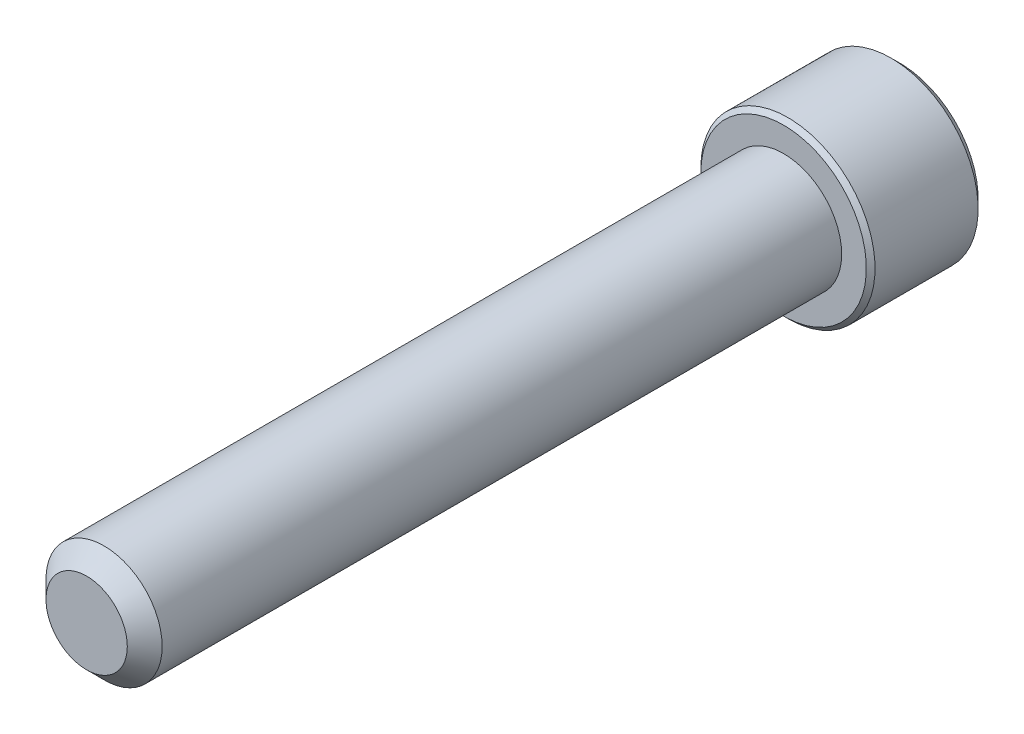
ISO-10303-21;
HEADER;
FILE_DESCRIPTION(('STEP AP214'),'2;1');
FILE_NAME('part.step','',(''),(''),'','','');
FILE_SCHEMA(('AUTOMOTIVE_DESIGN { 1 0 10303 214 1 1 1 1 }'));
ENDSEC;
DATA;
#1=APPLICATION_CONTEXT('core data for automotive mechanical design processes');
#2=APPLICATION_PROTOCOL_DEFINITION('international standard','automotive_design',2000,#1);
#3=PRODUCT_CONTEXT('',#1,'mechanical');
#4=PRODUCT('Part','Part','',(#3));
#5=PRODUCT_RELATED_PRODUCT_CATEGORY('part','',(#4));
#6=PRODUCT_DEFINITION_FORMATION('','',#4);
#7=PRODUCT_DEFINITION_CONTEXT('part definition',#1,'design');
#8=PRODUCT_DEFINITION('design','',#6,#7);
#9=PRODUCT_DEFINITION_SHAPE('','',#8);
#10=(LENGTH_UNIT() NAMED_UNIT(*) SI_UNIT(.MILLI.,.METRE.));
#11=(NAMED_UNIT(*) PLANE_ANGLE_UNIT() SI_UNIT($,.RADIAN.));
#12=(NAMED_UNIT(*) SI_UNIT($,.STERADIAN.) SOLID_ANGLE_UNIT());
#13=UNCERTAINTY_MEASURE_WITH_UNIT(LENGTH_MEASURE(1.E-05),#10,'distance_accuracy_value','');
#14=(GEOMETRIC_REPRESENTATION_CONTEXT(3) GLOBAL_UNCERTAINTY_ASSIGNED_CONTEXT((#13)) GLOBAL_UNIT_ASSIGNED_CONTEXT((#10,
#11,#12)) REPRESENTATION_CONTEXT('',''));
#15=CARTESIAN_POINT('',(0.,0.,0.));
#16=DIRECTION('',(0.,0.,1.));
#17=DIRECTION('',(1.,0.,0.));
#18=AXIS2_PLACEMENT_3D('',#15,#16,#17);
#19=CARTESIAN_POINT('',(0.,0.,-38.1));
#20=DIRECTION('',(0.,0.,1.));
#21=DIRECTION('',(1.,0.,0.));
#22=AXIS2_PLACEMENT_3D('',#19,#20,#21);
#23=CYLINDRICAL_SURFACE('',#22,3.175);
#24=CARTESIAN_POINT('',(0.,0.,-0.952499999999995));
#25=DIRECTION('',(0.,0.,1.));
#26=DIRECTION('',(1.,0.,0.));
#27=AXIS2_PLACEMENT_3D('',#24,#25,#26);
#28=CIRCLE('',#27,3.175);
#29=CARTESIAN_POINT('',(3.175,0.,-0.952499999999995));
#30=VERTEX_POINT('',#29);
#31=EDGE_CURVE('E109',#30,#30,#28,.F.);
#32=CARTESIAN_POINT('',(0.,0.,-38.1));
#33=DIRECTION('',(0.,0.,-1.));
#34=DIRECTION('',(-1.,0.,0.));
#35=AXIS2_PLACEMENT_3D('',#32,#33,#34);
#36=CIRCLE('',#35,3.175);
#37=CARTESIAN_POINT('',(3.175,0.,-38.1));
#38=VERTEX_POINT('',#37);
#39=EDGE_CURVE('E212',#38,#38,#36,.F.);
#40=CARTESIAN_POINT('',(3.175,0.,-0.952499999999995));
#41=CARTESIAN_POINT('',(3.175,0.,-1.339453125));
#42=CARTESIAN_POINT('',(3.175,0.,-1.72640625));
#43=CARTESIAN_POINT('',(3.175,0.,-2.5003125));
#44=CARTESIAN_POINT('',(3.175,0.,-2.887265625));
#45=CARTESIAN_POINT('',(3.175,0.,-3.661171875));
#46=CARTESIAN_POINT('',(3.175,0.,-4.048125));
#47=CARTESIAN_POINT('',(3.175,0.,-4.82203125));
#48=CARTESIAN_POINT('',(3.175,0.,-5.208984375));
#49=CARTESIAN_POINT('',(3.175,0.,-5.982890625));
#50=CARTESIAN_POINT('',(3.175,0.,-6.36984375));
#51=CARTESIAN_POINT('',(3.175,0.,-7.14375));
#52=CARTESIAN_POINT('',(3.175,0.,-7.53070312499999));
#53=CARTESIAN_POINT('',(3.175,0.,-8.30460937499999));
#54=CARTESIAN_POINT('',(3.175,0.,-8.69156249999999));
#55=CARTESIAN_POINT('',(3.175,0.,-9.46546874999999));
#56=CARTESIAN_POINT('',(3.175,0.,-9.85242187499999));
#57=CARTESIAN_POINT('',(3.175,0.,-10.626328125));
#58=CARTESIAN_POINT('',(3.175,0.,-11.01328125));
#59=CARTESIAN_POINT('',(3.175,0.,-11.7871875));
#60=CARTESIAN_POINT('',(3.175,0.,-12.174140625));
#61=CARTESIAN_POINT('',(3.175,0.,-12.948046875));
#62=CARTESIAN_POINT('',(3.175,0.,-13.335));
#63=CARTESIAN_POINT('',(3.175,0.,-14.10890625));
#64=CARTESIAN_POINT('',(3.175,0.,-14.495859375));
#65=CARTESIAN_POINT('',(3.175,0.,-15.269765625));
#66=CARTESIAN_POINT('',(3.175,0.,-15.65671875));
#67=CARTESIAN_POINT('',(3.175,0.,-16.430625));
#68=CARTESIAN_POINT('',(3.175,0.,-16.817578125));
#69=CARTESIAN_POINT('',(3.175,0.,-17.591484375));
#70=CARTESIAN_POINT('',(3.175,0.,-17.9784375));
#71=CARTESIAN_POINT('',(3.175,0.,-18.75234375));
#72=CARTESIAN_POINT('',(3.175,0.,-19.139296875));
#73=CARTESIAN_POINT('',(3.175,0.,-19.913203125));
#74=CARTESIAN_POINT('',(3.175,0.,-20.30015625));
#75=CARTESIAN_POINT('',(3.175,0.,-21.0740625));
#76=CARTESIAN_POINT('',(3.175,0.,-21.461015625));
#77=CARTESIAN_POINT('',(3.175,0.,-22.234921875));
#78=CARTESIAN_POINT('',(3.175,0.,-22.621875));
#79=CARTESIAN_POINT('',(3.175,0.,-23.39578125));
#80=CARTESIAN_POINT('',(3.175,0.,-23.782734375));
#81=CARTESIAN_POINT('',(3.175,0.,-24.556640625));
#82=CARTESIAN_POINT('',(3.175,0.,-24.94359375));
#83=CARTESIAN_POINT('',(3.175,0.,-25.7175));
#84=CARTESIAN_POINT('',(3.175,0.,-26.104453125));
#85=CARTESIAN_POINT('',(3.175,0.,-26.878359375));
#86=CARTESIAN_POINT('',(3.175,0.,-27.2653125));
#87=CARTESIAN_POINT('',(3.175,0.,-28.03921875));
#88=CARTESIAN_POINT('',(3.175,0.,-28.426171875));
#89=CARTESIAN_POINT('',(3.175,0.,-29.200078125));
#90=CARTESIAN_POINT('',(3.175,0.,-29.58703125));
#91=CARTESIAN_POINT('',(3.175,0.,-30.3609375));
#92=CARTESIAN_POINT('',(3.175,0.,-30.747890625));
#93=CARTESIAN_POINT('',(3.175,0.,-31.521796875));
#94=CARTESIAN_POINT('',(3.175,0.,-31.90875));
#95=CARTESIAN_POINT('',(3.175,0.,-32.68265625));
#96=CARTESIAN_POINT('',(3.175,0.,-33.069609375));
#97=CARTESIAN_POINT('',(3.175,0.,-33.843515625));
#98=CARTESIAN_POINT('',(3.175,0.,-34.23046875));
#99=CARTESIAN_POINT('',(3.175,0.,-35.004375));
#100=CARTESIAN_POINT('',(3.175,0.,-35.391328125));
#101=CARTESIAN_POINT('',(3.175,0.,-36.165234375));
#102=CARTESIAN_POINT('',(3.175,0.,-36.5521875));
#103=CARTESIAN_POINT('',(3.175,0.,-37.32609375));
#104=CARTESIAN_POINT('',(3.175,0.,-37.713046875));
#105=CARTESIAN_POINT('',(3.175,0.,-38.1));
#106=B_SPLINE_CURVE_WITH_KNOTS('',3,(#40,#41,#42,#43,#44,#45,#46,#47,#48,#49,#50,#51,#52,#53,
#54,#55,#56,#57,#58,#59,#60,#61,#62,#63,#64,#65,#66,#67,#68,#69,#70,#71,#72,#73,#74,#75,#76,#77,
#78,#79,#80,#81,#82,#83,#84,#85,#86,#87,#88,#89,#90,#91,#92,#93,#94,#95,#96,#97,#98,#99,#100,
#101,#102,#103,#104,#105),.UNSPECIFIED.,.F.,.F.,(4,2,2,2,2,2,2,2,2,2,2,2,2,2,2,2,2,2,2,2,2,2,2,
2,2,2,2,2,2,2,2,2,4),(0.,1.160859375,2.32171875,3.482578125,4.6434375,5.804296875,6.96515625,
8.126015625,9.286875,10.447734375,11.60859375,12.769453125,13.9303125,15.091171875,16.25203125,
17.412890625,18.57375,19.734609375,20.89546875,22.056328125,23.2171875,24.378046875,25.53890625,
26.699765625,27.860625,29.021484375,30.18234375,31.343203125,32.5040625,33.664921875,
34.82578125,35.986640625,37.1475),.UNSPECIFIED.);
#107=EDGE_CURVE('BSEAM35',#30,#38,#106,.T.);
#108=ORIENTED_EDGE('',*,*,#31,.T.);
#109=ORIENTED_EDGE('',*,*,#39,.T.);
#110=ORIENTED_EDGE('',*,*,#107,.T.);
#111=ORIENTED_EDGE('',*,*,#107,.F.);
#112=EDGE_LOOP('',(#108,#110,#109,#111));
#113=FACE_BOUND('',#112,.T.);
#114=ADVANCED_FACE('F35',(#113),#23,.T.);
#115=CARTESIAN_POINT('',(0.,0.,0.));
#116=DIRECTION('',(0.,0.,1.));
#117=DIRECTION('',(1.,0.,0.));
#118=AXIS2_PLACEMENT_3D('',#115,#116,#117);
#119=PLANE('',#118);
#120=CARTESIAN_POINT('',(0.,0.,0.));
#121=DIRECTION('',(0.,0.,1.));
#122=DIRECTION('',(1.,0.,0.));
#123=AXIS2_PLACEMENT_3D('',#120,#121,#122);
#124=CIRCLE('',#123,2.2225);
#125=CARTESIAN_POINT('',(2.2225,0.,0.));
#126=VERTEX_POINT('',#125);
#127=EDGE_CURVE('E211',#126,#126,#124,.T.);
#128=ORIENTED_EDGE('',*,*,#127,.T.);
#129=EDGE_LOOP('',(#128));
#130=FACE_BOUND('',#129,.T.);
#131=ADVANCED_FACE('F189',(#130),#119,.T.);
#132=CARTESIAN_POINT('',(0.,0.,0.));
#133=DIRECTION('',(0.,0.,-1.));
#134=DIRECTION('',(-1.,0.,0.));
#135=AXIS2_PLACEMENT_3D('',#132,#133,#134);
#136=CONICAL_SURFACE('',#135,2.2225,0.78539816339745);
#137=ORIENTED_EDGE('',*,*,#31,.F.);
#138=EDGE_LOOP('',(#137));
#139=FACE_BOUND('',#138,.T.);
#140=ORIENTED_EDGE('',*,*,#127,.F.);
#141=EDGE_LOOP('',(#140));
#142=FACE_BOUND('',#141,.T.);
#143=ADVANCED_FACE('F195',(#139,#142),#136,.T.);
#144=CARTESIAN_POINT('',(0.,0.,-44.45));
#145=DIRECTION('',(0.,0.,1.));
#146=DIRECTION('',(1.,0.,0.));
#147=AXIS2_PLACEMENT_3D('',#144,#145,#146);
#148=CYLINDRICAL_SURFACE('',#147,4.7625);
#149=CARTESIAN_POINT('',(0.,0.,-38.338125));
#150=DIRECTION('',(0.,0.,-1.));
#151=DIRECTION('',(-1.,0.,0.));
#152=AXIS2_PLACEMENT_3D('',#149,#150,#151);
#153=CIRCLE('',#152,4.7625);
#154=CARTESIAN_POINT('',(-4.7625,0.,-38.338125));
#155=VERTEX_POINT('',#154);
#156=EDGE_CURVE('E43',#155,#155,#153,.T.);
#157=ORIENTED_EDGE('',*,*,#156,.T.);
#158=EDGE_LOOP('',(#157));
#159=FACE_BOUND('',#158,.T.);
#160=CARTESIAN_POINT('',(0.,0.,-43.97375));
#161=DIRECTION('',(0.,0.,-1.));
#162=DIRECTION('',(-1.,0.,0.));
#163=AXIS2_PLACEMENT_3D('',#160,#161,#162);
#164=CIRCLE('',#163,4.7625);
#165=CARTESIAN_POINT('',(-4.7625,0.,-43.97375));
#166=VERTEX_POINT('',#165);
#167=EDGE_CURVE('E172',#166,#166,#164,.F.);
#168=ORIENTED_EDGE('',*,*,#167,.T.);
#169=EDGE_LOOP('',(#168));
#170=FACE_BOUND('',#169,.T.);
#171=ADVANCED_FACE('F177',(#159,#170),#148,.T.);
#172=CARTESIAN_POINT('',(0.,0.,-44.45));
#173=DIRECTION('',(0.,0.,-1.));
#174=DIRECTION('',(-1.,0.,0.));
#175=AXIS2_PLACEMENT_3D('',#172,#173,#174);
#176=PLANE('',#175);
#177=CARTESIAN_POINT('',(0.,0.,-44.45));
#178=DIRECTION('',(0.,0.,-1.));
#179=DIRECTION('',(-1.,0.,0.));
#180=AXIS2_PLACEMENT_3D('',#177,#178,#179);
#181=CIRCLE('',#180,4.28625000000001);
#182=CARTESIAN_POINT('',(-4.28625000000001,0.,-44.45));
#183=VERTEX_POINT('',#182);
#184=EDGE_CURVE('E108',#183,#183,#181,.T.);
#185=ORIENTED_EDGE('',*,*,#184,.T.);
#186=EDGE_LOOP('',(#185));
#187=FACE_BOUND('',#186,.T.);
#188=CARTESIAN_POINT('',(0.,0.,-44.45));
#189=DIRECTION('',(0.,0.,-1.));
#190=DIRECTION('',(-1.,0.,0.));
#191=AXIS2_PLACEMENT_3D('',#188,#189,#190);
#192=CIRCLE('',#191,2.74963065701559);
#193=CARTESIAN_POINT('',(-2.38125,1.3748153285078,-44.45));
#194=VERTEX_POINT('',#193);
#195=CARTESIAN_POINT('',(0.,2.74963065701559,-44.45));
#196=VERTEX_POINT('',#195);
#197=EDGE_CURVE('E89',#194,#196,#192,.T.);
#198=ORIENTED_EDGE('',*,*,#197,.F.);
#199=CARTESIAN_POINT('',(-2.38125,-1.3748153285078,-44.45));
#200=VERTEX_POINT('',#199);
#201=EDGE_CURVE('E49',#200,#194,#192,.T.);
#202=ORIENTED_EDGE('',*,*,#201,.F.);
#203=CARTESIAN_POINT('',(0.,-2.74963065701559,-44.45));
#204=VERTEX_POINT('',#203);
#205=EDGE_CURVE('E271',#204,#200,#192,.T.);
#206=ORIENTED_EDGE('',*,*,#205,.F.);
#207=CARTESIAN_POINT('',(2.38125,-1.37481532850779,-44.45));
#208=VERTEX_POINT('',#207);
#209=EDGE_CURVE('E56',#208,#204,#192,.T.);
#210=ORIENTED_EDGE('',*,*,#209,.F.);
#211=CARTESIAN_POINT('',(2.38125,1.3748153285078,-44.45));
#212=VERTEX_POINT('',#211);
#213=EDGE_CURVE('E130',#212,#208,#192,.T.);
#214=ORIENTED_EDGE('',*,*,#213,.F.);
#215=EDGE_CURVE('E98',#196,#212,#192,.T.);
#216=ORIENTED_EDGE('',*,*,#215,.F.);
#217=EDGE_LOOP('',(#198,#202,#206,#210,#214,#216));
#218=FACE_BOUND('',#217,.T.);
#219=ADVANCED_FACE('F129',(#187,#218),#176,.T.);
#220=CARTESIAN_POINT('',(0.,0.,-38.1));
#221=DIRECTION('',(0.,0.,-1.));
#222=DIRECTION('',(-1.,0.,0.));
#223=AXIS2_PLACEMENT_3D('',#220,#221,#222);
#224=PLANE('',#223);
#225=CARTESIAN_POINT('',(0.,0.,-38.1));
#226=DIRECTION('',(0.,0.,-1.));
#227=DIRECTION('',(-1.,0.,0.));
#228=AXIS2_PLACEMENT_3D('',#225,#226,#227);
#229=CIRCLE('',#228,4.524375);
#230=CARTESIAN_POINT('',(-4.524375,0.,-38.1));
#231=VERTEX_POINT('',#230);
#232=EDGE_CURVE('E11',#231,#231,#229,.F.);
#233=ORIENTED_EDGE('',*,*,#232,.T.);
#234=EDGE_LOOP('',(#233));
#235=FACE_BOUND('',#234,.T.);
#236=ORIENTED_EDGE('',*,*,#39,.F.);
#237=EDGE_LOOP('',(#236));
#238=FACE_BOUND('',#237,.T.);
#239=ADVANCED_FACE('F283',(#235,#238),#224,.F.);
#240=CARTESIAN_POINT('',(0.,0.,-44.45));
#241=DIRECTION('',(0.,0.,-1.));
#242=DIRECTION('',(-1.,0.,0.));
#243=AXIS2_PLACEMENT_3D('',#240,#241,#242);
#244=CONICAL_SURFACE('',#243,2.74963065701559,0.78539816339745);
#245=ORIENTED_EDGE('',*,*,#215,.T.);
#246=CARTESIAN_POINT('',(-0.000199999999999959,2.74974612706943,-44.4501154773272));
#247=CARTESIAN_POINT('',(0.0816567823790505,2.70248609172789,-44.4028948967095));
#248=CARTESIAN_POINT('',(0.164882333771761,2.65443579722785,-44.3584475752929));
#249=CARTESIAN_POINT('',(0.334588480838041,2.556455907536,-44.2770654569856));
#250=CARTESIAN_POINT('',(0.421085217353104,2.506516993425,-44.2401759430951));
#251=CARTESIAN_POINT('',(0.595501774009043,2.40581754748857,-44.1769834131659));
#252=CARTESIAN_POINT('',(0.683377171180675,2.35508266327638,-44.1505215587295));
#253=CARTESIAN_POINT('',(0.861062594070876,2.25249593653965,-44.1097515156161));
#254=CARTESIAN_POINT('',(0.950867191185871,2.20064722822085,-44.0954128915306));
#255=CARTESIAN_POINT('',(1.10563960313034,2.11128933452158,-44.0824757847701));
#256=CARTESIAN_POINT('',(1.17040744896962,2.07389560129144,-44.0805606046532));
#257=CARTESIAN_POINT('',(1.29983727933557,1.99916925388849,-44.0837866227677));
#258=CARTESIAN_POINT('',(1.36449921879336,1.96183666573621,-44.0889302948571));
#259=CARTESIAN_POINT('',(1.4932125485774,1.8875239901371,-44.1059813108716));
#260=CARTESIAN_POINT('',(1.55726317423486,1.85054434417201,-44.1178962213493));
#261=CARTESIAN_POINT('',(1.68425683890527,1.77722451768916,-44.147835672352));
#262=CARTESIAN_POINT('',(1.74719996243582,1.74088428837516,-44.1658597445185));
#263=CARTESIAN_POINT('',(1.90842615073218,1.64780030516185,-44.2193688075524));
#264=CARTESIAN_POINT('',(2.00570949128784,1.59163374230437,-44.2588874208722));
#265=CARTESIAN_POINT('',(2.14875606262557,1.50904576583588,-44.3256003435508));
#266=CARTESIAN_POINT('',(2.19589628894396,1.4818293434813,-44.3490402091113));
#267=CARTESIAN_POINT('',(2.28930352636664,1.42790064981106,-44.3980566766595));
#268=CARTESIAN_POINT('',(2.33557105249682,1.40118808114506,-44.4236319667669));
#269=CARTESIAN_POINT('',(2.38145,1.37469985845396,-44.4501154773272));
#270=B_SPLINE_CURVE_WITH_KNOTS('',3,(#246,#247,#248,#249,#250,#251,#252,#253,#254,#255,#256,
#257,#258,#259,#260,#261,#262,#263,#264,#265,#266,#267,#268,#269),.UNSPECIFIED.,.F.,.F.,(4,2,2,
2,2,2,2,2,2,2,2,4),(0.,0.31719661061195,0.636241461041218,0.950218950629221,1.26340583824126,
1.48752413747844,1.71172100167747,1.93616888974082,2.16059957440836,2.51709639744762,
2.69486147369098,2.87251813383153),.UNSPECIFIED.);
#271=EDGE_CURVE('E103',#196,#212,#270,.T.);
#272=ORIENTED_EDGE('',*,*,#271,.F.);
#273=EDGE_LOOP('',(#245,#272));
#274=FACE_BOUND('',#273,.T.);
#275=ADVANCED_FACE('F104',(#274),#244,.F.);
#276=ORIENTED_EDGE('',*,*,#213,.T.);
#277=CARTESIAN_POINT('',(2.38125,-2.74194290589386,-45.3319808945799));
#278=CARTESIAN_POINT('',(2.38125,-2.67517961056039,-45.2815846679781));
#279=CARTESIAN_POINT('',(2.38125,-2.60804251112752,-45.2316755875907));
#280=CARTESIAN_POINT('',(2.38125,-2.47287325055307,-45.1330498309857));
#281=CARTESIAN_POINT('',(2.38125,-2.40484086895313,-45.0843334572448));
#282=CARTESIAN_POINT('',(2.38125,-2.26723593505441,-44.9879648544535));
#283=CARTESIAN_POINT('',(2.38125,-2.19765553346049,-44.9403237954326));
#284=CARTESIAN_POINT('',(2.38125,-2.05731367842203,-44.8468199233866));
#285=CARTESIAN_POINT('',(2.38125,-1.98655230892573,-44.8009569847287));
#286=CARTESIAN_POINT('',(2.38125,-1.83957751909225,-44.7088459007133));
#287=CARTESIAN_POINT('',(2.38125,-1.76328361992075,-44.6627255173929));
#288=CARTESIAN_POINT('',(2.38125,-1.6089135770446,-44.5735183038905));
#289=CARTESIAN_POINT('',(2.38125,-1.53083712149137,-44.5304320099754));
#290=CARTESIAN_POINT('',(2.38125,-1.37291620334514,-44.4482265014712));
#291=CARTESIAN_POINT('',(2.38125,-1.29307799938228,-44.4090953578519));
#292=CARTESIAN_POINT('',(2.38125,-1.13121425093132,-44.3356679503152));
#293=CARTESIAN_POINT('',(2.38125,-1.04918943681795,-44.3013700954538));
#294=CARTESIAN_POINT('',(2.38125,-0.889535256759271,-44.2413546314156));
#295=CARTESIAN_POINT('',(2.38125,-0.812083865770258,-44.215168478432));
#296=CARTESIAN_POINT('',(2.38125,-0.655316366527661,-44.1690097514868));
#297=CARTESIAN_POINT('',(2.38125,-0.57600013021683,-44.1490376055837));
#298=CARTESIAN_POINT('',(2.38125,-0.417295761573375,-44.1166821452488));
#299=CARTESIAN_POINT('',(2.38125,-0.337934576883846,-44.1041688083547));
#300=CARTESIAN_POINT('',(2.38125,-0.178363852969583,-44.0869738601659));
#301=CARTESIAN_POINT('',(2.38125,-0.0981544619617664,-44.0822909026126));
#302=CARTESIAN_POINT('',(2.38125,0.0594188034321297,-44.0811044408392));
#303=CARTESIAN_POINT('',(2.38125,0.136780588525993,-44.0843110105046));
#304=CARTESIAN_POINT('',(2.38125,0.290840960607338,-44.0980870567428));
#305=CARTESIAN_POINT('',(2.38125,0.367539482435409,-44.1086572485871));
#306=CARTESIAN_POINT('',(2.38125,0.521017492835387,-44.1367628298525));
#307=CARTESIAN_POINT('',(2.38125,0.597774958394047,-44.1544167489315));
#308=CARTESIAN_POINT('',(2.38125,0.749609814257008,-44.1957513962434));
#309=CARTESIAN_POINT('',(2.38125,0.824687344568025,-44.2194316201904));
#310=CARTESIAN_POINT('',(2.38125,1.06107814410025,-44.302894862956));
#311=CARTESIAN_POINT('',(2.38125,1.2190478622181,-44.3721839270396));
#312=CARTESIAN_POINT('',(2.38125,1.45021000267341,-44.4876640838597));
#313=CARTESIAN_POINT('',(2.38125,1.52644290442584,-44.5281730572583));
#314=CARTESIAN_POINT('',(2.38125,1.67717618538171,-44.6123026892371));
#315=CARTESIAN_POINT('',(2.38125,1.75167687358839,-44.6559227870999));
#316=CARTESIAN_POINT('',(2.38125,1.89548152088327,-44.743412556489));
#317=CARTESIAN_POINT('',(2.38125,1.96485959608998,-44.7871617927418));
#318=CARTESIAN_POINT('',(2.38125,2.10242624411168,-44.8765011587306));
#319=CARTESIAN_POINT('',(2.38125,2.17061472626633,-44.922091427904));
#320=CARTESIAN_POINT('',(2.38125,2.30540317317353,-45.0144060050932));
#321=CARTESIAN_POINT('',(2.38125,2.37201154222166,-45.0611180928962));
#322=CARTESIAN_POINT('',(2.38125,2.50431800054459,-45.1557775780183));
#323=CARTESIAN_POINT('',(2.38125,2.57001633510792,-45.2037246320963));
#324=CARTESIAN_POINT('',(2.38125,2.63533378855946,-45.2521767335425));
#325=B_SPLINE_CURVE_WITH_KNOTS('',3,(#277,#278,#279,#280,#281,#282,#283,#284,#285,#286,#287,
#288,#289,#290,#291,#292,#293,#294,#295,#296,#297,#298,#299,#300,#301,#302,#303,#304,#305,#306,
#307,#308,#309,#310,#311,#312,#313,#314,#315,#316,#317,#318,#319,#320,#321,#322,#323,#324),
.UNSPECIFIED.,.F.,.F.,(4,2,2,2,2,2,2,2,2,2,2,2,2,2,2,2,2,2,2,2,2,2,2,4),(0.,0.250951284009982,
0.501965564827879,0.754924775973582,1.00786608164542,1.27526207798892,1.54270521780082,
1.80931602029339,2.07583885812519,2.32089852590463,2.56597507114535,2.80664400307698,
3.04727155311264,3.27918940971451,3.51112979698761,3.74712477407482,3.98310000940111,
4.49898139184704,4.75794323931353,5.01685853149447,5.2628896001536,5.50893933794671,
5.75299038397141,5.9969743162797),.UNSPECIFIED.);
#326=EDGE_CURVE('E97',#212,#208,#325,.F.);
#327=ORIENTED_EDGE('',*,*,#326,.F.);
#328=EDGE_LOOP('',(#276,#327));
#329=FACE_BOUND('',#328,.T.);
#330=ADVANCED_FACE('F277',(#329),#244,.F.);
#331=ORIENTED_EDGE('',*,*,#209,.T.);
#332=CARTESIAN_POINT('',(2.38145,-1.37469985845396,-44.4501154773272));
#333=CARTESIAN_POINT('',(2.29959321762095,-1.4219598937955,-44.4028948967095));
#334=CARTESIAN_POINT('',(2.21636766622824,-1.47001018829554,-44.3584475752929));
#335=CARTESIAN_POINT('',(2.04666151916196,-1.56799007798739,-44.2770654569856));
#336=CARTESIAN_POINT('',(1.9601647826469,-1.61792899209838,-44.2401759430951));
#337=CARTESIAN_POINT('',(1.78574822599096,-1.71862843803482,-44.1769834131659));
#338=CARTESIAN_POINT('',(1.69787282881932,-1.769363322247,-44.1505215587295));
#339=CARTESIAN_POINT('',(1.52018740592912,-1.87195004898373,-44.1097515156161));
#340=CARTESIAN_POINT('',(1.43038280881413,-1.92379875730254,-44.0954128915306));
#341=CARTESIAN_POINT('',(1.27561039686966,-2.01315665100181,-44.0824757847701));
#342=CARTESIAN_POINT('',(1.21084255103038,-2.05055038423195,-44.0805606046532));
#343=CARTESIAN_POINT('',(1.08141272066443,-2.1252767316349,-44.0837866227677));
#344=CARTESIAN_POINT('',(1.01675078120664,-2.16260931978717,-44.0889302948571));
#345=CARTESIAN_POINT('',(0.888037451422602,-2.23692199538628,-44.1059813108716));
#346=CARTESIAN_POINT('',(0.823986825765144,-2.27390164135138,-44.1178962213493));
#347=CARTESIAN_POINT('',(0.696993161094725,-2.34722146783422,-44.147835672352));
#348=CARTESIAN_POINT('',(0.634050037564175,-2.38356169714822,-44.1658597445185));
#349=CARTESIAN_POINT('',(0.472823849267819,-2.47664568036154,-44.2193688075524));
#350=CARTESIAN_POINT('',(0.375540508712161,-2.53281224321902,-44.2588874208722));
#351=CARTESIAN_POINT('',(0.232493937374432,-2.61540021968751,-44.3256003435508));
#352=CARTESIAN_POINT('',(0.185353711056038,-2.64261664204209,-44.3490402091113));
#353=CARTESIAN_POINT('',(0.091946473633364,-2.69654533571233,-44.3980566766595));
#354=CARTESIAN_POINT('',(0.0456789475031806,-2.72325790437833,-44.4236319667669));
#355=CARTESIAN_POINT('',(-0.000199999999998796,-2.74974612706943,-44.4501154773272));
#356=B_SPLINE_CURVE_WITH_KNOTS('',3,(#332,#333,#334,#335,#336,#337,#338,#339,#340,#341,#342,
#343,#344,#345,#346,#347,#348,#349,#350,#351,#352,#353,#354,#355),.UNSPECIFIED.,.F.,.F.,(4,2,2,
2,2,2,2,2,2,2,2,4),(0.,0.317196610611949,0.636241461041218,0.950218950629223,1.26340583824126,
1.48752413747844,1.71172100167747,1.93616888974082,2.16059957440836,2.51709639744762,
2.69486147369098,2.87251813383153),.UNSPECIFIED.);
#357=EDGE_CURVE('E140',#208,#204,#356,.T.);
#358=ORIENTED_EDGE('',*,*,#357,.F.);
#359=EDGE_LOOP('',(#331,#358));
#360=FACE_BOUND('',#359,.T.);
#361=ADVANCED_FACE('F274',(#360),#244,.F.);
#362=ORIENTED_EDGE('',*,*,#205,.T.);
#363=CARTESIAN_POINT('',(0.000199999999999388,-2.74974612706943,-44.4501154773272));
#364=CARTESIAN_POINT('',(-0.0816567823790512,-2.70248609172789,-44.4028948967095));
#365=CARTESIAN_POINT('',(-0.164882333771762,-2.65443579722785,-44.3584475752929));
#366=CARTESIAN_POINT('',(-0.334588480838042,-2.556455907536,-44.2770654569856));
#367=CARTESIAN_POINT('',(-0.421085217353105,-2.50651699342501,-44.2401759430951));
#368=CARTESIAN_POINT('',(-0.595501774009044,-2.40581754748857,-44.1769834131659));
#369=CARTESIAN_POINT('',(-0.683377171180677,-2.35508266327638,-44.1505215587295));
#370=CARTESIAN_POINT('',(-0.861062594070877,-2.25249593653965,-44.1097515156161));
#371=CARTESIAN_POINT('',(-0.950867191185872,-2.20064722822085,-44.0954128915306));
#372=CARTESIAN_POINT('',(-1.10563960313034,-2.11128933452158,-44.0824757847701));
#373=CARTESIAN_POINT('',(-1.17040744896962,-2.07389560129144,-44.0805606046532));
#374=CARTESIAN_POINT('',(-1.29983727933558,-1.99916925388849,-44.0837866227677));
#375=CARTESIAN_POINT('',(-1.36449921879336,-1.96183666573621,-44.0889302948571));
#376=CARTESIAN_POINT('',(-1.4932125485774,-1.8875239901371,-44.1059813108716));
#377=CARTESIAN_POINT('',(-1.55726317423486,-1.85054434417201,-44.1178962213493));
#378=CARTESIAN_POINT('',(-1.68425683890528,-1.77722451768916,-44.147835672352));
#379=CARTESIAN_POINT('',(-1.74719996243583,-1.74088428837517,-44.1658597445185));
#380=CARTESIAN_POINT('',(-1.90842615073218,-1.64780030516185,-44.2193688075524));
#381=CARTESIAN_POINT('',(-2.00570949128784,-1.59163374230437,-44.2588874208722));
#382=CARTESIAN_POINT('',(-2.14875606262557,-1.50904576583588,-44.3256003435508));
#383=CARTESIAN_POINT('',(-2.19589628894396,-1.4818293434813,-44.3490402091113));
#384=CARTESIAN_POINT('',(-2.28930352636664,-1.42790064981106,-44.3980566766595));
#385=CARTESIAN_POINT('',(-2.33557105249682,-1.40118808114506,-44.4236319667669));
#386=CARTESIAN_POINT('',(-2.38145,-1.37469985845396,-44.4501154773272));
#387=B_SPLINE_CURVE_WITH_KNOTS('',3,(#363,#364,#365,#366,#367,#368,#369,#370,#371,#372,#373,
#374,#375,#376,#377,#378,#379,#380,#381,#382,#383,#384,#385,#386),.UNSPECIFIED.,.F.,.F.,(4,2,2,
2,2,2,2,2,2,2,2,4),(0.,0.317196610611951,0.636241461041219,0.950218950629223,1.26340583824126,
1.48752413747844,1.71172100167747,1.93616888974082,2.16059957440836,2.51709639744763,
2.69486147369099,2.87251813383153),.UNSPECIFIED.);
#388=EDGE_CURVE('E248',#204,#200,#387,.T.);
#389=ORIENTED_EDGE('',*,*,#388,.F.);
#390=EDGE_LOOP('',(#362,#389));
#391=FACE_BOUND('',#390,.T.);
#392=ADVANCED_FACE('F273',(#391),#244,.F.);
#393=ORIENTED_EDGE('',*,*,#201,.T.);
#394=CARTESIAN_POINT('',(-2.38125,-2.74194290589387,-45.3319808945799));
#395=CARTESIAN_POINT('',(-2.38125,-2.67517961056039,-45.2815846679781));
#396=CARTESIAN_POINT('',(-2.38125,-2.60804251112752,-45.2316755875907));
#397=CARTESIAN_POINT('',(-2.38125,-2.47287325055307,-45.1330498309857));
#398=CARTESIAN_POINT('',(-2.38125,-2.40484086895313,-45.0843334572448));
#399=CARTESIAN_POINT('',(-2.38125,-2.26723593505441,-44.9879648544535));
#400=CARTESIAN_POINT('',(-2.38125,-2.19765553346049,-44.9403237954326));
#401=CARTESIAN_POINT('',(-2.38125,-2.05731367842203,-44.8468199233866));
#402=CARTESIAN_POINT('',(-2.38125,-1.98655230892573,-44.8009569847287));
#403=CARTESIAN_POINT('',(-2.38125,-1.83957751909226,-44.7088459007133));
#404=CARTESIAN_POINT('',(-2.38125,-1.76328361992076,-44.6627255173929));
#405=CARTESIAN_POINT('',(-2.38125,-1.6089135770446,-44.5735183038905));
#406=CARTESIAN_POINT('',(-2.38125,-1.53083712149137,-44.5304320099754));
#407=CARTESIAN_POINT('',(-2.38125,-1.37291620334514,-44.4482265014712));
#408=CARTESIAN_POINT('',(-2.38125,-1.29307799938228,-44.4090953578519));
#409=CARTESIAN_POINT('',(-2.38125,-1.13121425093132,-44.3356679503152));
#410=CARTESIAN_POINT('',(-2.38125,-1.04918943681796,-44.3013700954538));
#411=CARTESIAN_POINT('',(-2.38125,-0.889535256759272,-44.2413546314156));
#412=CARTESIAN_POINT('',(-2.38125,-0.81208386577026,-44.215168478432));
#413=CARTESIAN_POINT('',(-2.38125,-0.655316366527663,-44.1690097514868));
#414=CARTESIAN_POINT('',(-2.38125,-0.576000130216832,-44.1490376055837));
#415=CARTESIAN_POINT('',(-2.38125,-0.417295761573376,-44.1166821452488));
#416=CARTESIAN_POINT('',(-2.38125,-0.337934576883848,-44.1041688083547));
#417=CARTESIAN_POINT('',(-2.38125,-0.178363852969584,-44.0869738601659));
#418=CARTESIAN_POINT('',(-2.38125,-0.0981544619617679,-44.0822909026126));
#419=CARTESIAN_POINT('',(-2.38125,0.0594188034321285,-44.0811044408392));
#420=CARTESIAN_POINT('',(-2.38125,0.136780588525992,-44.0843110105046));
#421=CARTESIAN_POINT('',(-2.38125,0.290840960607338,-44.0980870567428));
#422=CARTESIAN_POINT('',(-2.38125,0.367539482435409,-44.1086572485871));
#423=CARTESIAN_POINT('',(-2.38125,0.521017492835388,-44.1367628298525));
#424=CARTESIAN_POINT('',(-2.38125,0.597774958394048,-44.1544167489315));
#425=CARTESIAN_POINT('',(-2.38125,0.749609814257009,-44.1957513962434));
#426=CARTESIAN_POINT('',(-2.38125,0.824687344568026,-44.2194316201904));
#427=CARTESIAN_POINT('',(-2.38125,1.06107814410025,-44.302894862956));
#428=CARTESIAN_POINT('',(-2.38125,1.2190478622181,-44.3721839270396));
#429=CARTESIAN_POINT('',(-2.38125,1.45021000267342,-44.4876640838597));
#430=CARTESIAN_POINT('',(-2.38125,1.52644290442584,-44.5281730572583));
#431=CARTESIAN_POINT('',(-2.38125,1.67717618538172,-44.6123026892371));
#432=CARTESIAN_POINT('',(-2.38125,1.7516768735884,-44.6559227870999));
#433=CARTESIAN_POINT('',(-2.38125,1.89548152088327,-44.743412556489));
#434=CARTESIAN_POINT('',(-2.38125,1.96485959608998,-44.7871617927418));
#435=CARTESIAN_POINT('',(-2.38125,2.10242624411168,-44.8765011587306));
#436=CARTESIAN_POINT('',(-2.38125,2.17061472626633,-44.922091427904));
#437=CARTESIAN_POINT('',(-2.38125,2.30540317317354,-45.0144060050932));
#438=CARTESIAN_POINT('',(-2.38125,2.37201154222166,-45.0611180928962));
#439=CARTESIAN_POINT('',(-2.38125,2.50431800054459,-45.1557775780183));
#440=CARTESIAN_POINT('',(-2.38125,2.57001633510792,-45.2037246320963));
#441=CARTESIAN_POINT('',(-2.38125,2.63533378855947,-45.2521767335425));
#442=B_SPLINE_CURVE_WITH_KNOTS('',3,(#394,#395,#396,#397,#398,#399,#400,#401,#402,#403,#404,
#405,#406,#407,#408,#409,#410,#411,#412,#413,#414,#415,#416,#417,#418,#419,#420,#421,#422,#423,
#424,#425,#426,#427,#428,#429,#430,#431,#432,#433,#434,#435,#436,#437,#438,#439,#440,#441),
.UNSPECIFIED.,.F.,.F.,(4,2,2,2,2,2,2,2,2,2,2,2,2,2,2,2,2,2,2,2,2,2,2,4),(0.,0.250951284009983,
0.501965564827881,0.754924775973583,1.00786608164542,1.27526207798892,1.54270521780082,
1.80931602029339,2.07583885812519,2.32089852590464,2.56597507114536,2.80664400307698,
3.04727155311265,3.27918940971451,3.51112979698762,3.74712477407483,3.98310000940112,
4.49898139184705,4.75794323931354,5.01685853149448,5.26288960015361,5.50893933794672,
5.75299038397142,5.9969743162797),.UNSPECIFIED.);
#443=EDGE_CURVE('E119',#200,#194,#442,.T.);
#444=ORIENTED_EDGE('',*,*,#443,.F.);
#445=EDGE_LOOP('',(#393,#444));
#446=FACE_BOUND('',#445,.T.);
#447=ADVANCED_FACE('F290',(#446),#244,.F.);
#448=ORIENTED_EDGE('',*,*,#197,.T.);
#449=CARTESIAN_POINT('',(-2.38145,1.37469985845396,-44.4501154773272));
#450=CARTESIAN_POINT('',(-2.29959321762095,1.4219598937955,-44.4028948967095));
#451=CARTESIAN_POINT('',(-2.21636766622824,1.47001018829554,-44.3584475752929));
#452=CARTESIAN_POINT('',(-2.04666151916196,1.56799007798739,-44.2770654569856));
#453=CARTESIAN_POINT('',(-1.9601647826469,1.61792899209838,-44.2401759430951));
#454=CARTESIAN_POINT('',(-1.78574822599095,1.71862843803482,-44.1769834131659));
#455=CARTESIAN_POINT('',(-1.69787282881932,1.76936332224701,-44.1505215587295));
#456=CARTESIAN_POINT('',(-1.52018740592912,1.87195004898374,-44.1097515156161));
#457=CARTESIAN_POINT('',(-1.43038280881413,1.92379875730254,-44.0954128915306));
#458=CARTESIAN_POINT('',(-1.27561039686966,2.01315665100181,-44.0824757847701));
#459=CARTESIAN_POINT('',(-1.21084255103038,2.05055038423195,-44.0805606046532));
#460=CARTESIAN_POINT('',(-1.08141272066442,2.1252767316349,-44.0837866227677));
#461=CARTESIAN_POINT('',(-1.01675078120664,2.16260931978717,-44.0889302948571));
#462=CARTESIAN_POINT('',(-0.888037451422601,2.23692199538628,-44.1059813108716));
#463=CARTESIAN_POINT('',(-0.823986825765143,2.27390164135138,-44.1178962213493));
#464=CARTESIAN_POINT('',(-0.696993161094724,2.34722146783422,-44.147835672352));
#465=CARTESIAN_POINT('',(-0.634050037564174,2.38356169714822,-44.1658597445185));
#466=CARTESIAN_POINT('',(-0.472823849267817,2.47664568036154,-44.2193688075524));
#467=CARTESIAN_POINT('',(-0.375540508712158,2.53281224321902,-44.2588874208722));
#468=CARTESIAN_POINT('',(-0.232493937374428,2.61540021968751,-44.3256003435508));
#469=CARTESIAN_POINT('',(-0.185353711056035,2.64261664204209,-44.3490402091113));
#470=CARTESIAN_POINT('',(-0.0919464736333622,2.69654533571233,-44.3980566766595));
#471=CARTESIAN_POINT('',(-0.0456789475031794,2.72325790437833,-44.4236319667669));
#472=CARTESIAN_POINT('',(0.000199999999999501,2.74974612706943,-44.4501154773272));
#473=B_SPLINE_CURVE_WITH_KNOTS('',3,(#449,#450,#451,#452,#453,#454,#455,#456,#457,#458,#459,
#460,#461,#462,#463,#464,#465,#466,#467,#468,#469,#470,#471,#472),.UNSPECIFIED.,.F.,.F.,(4,2,2,
2,2,2,2,2,2,2,2,4),(0.,0.317196610611948,0.636241461041218,0.950218950629223,1.26340583824126,
1.48752413747844,1.71172100167747,1.93616888974082,2.16059957440836,2.51709639744763,
2.69486147369099,2.87251813383153),.UNSPECIFIED.);
#474=EDGE_CURVE('E93',#194,#196,#473,.T.);
#475=ORIENTED_EDGE('',*,*,#474,.F.);
#476=EDGE_LOOP('',(#448,#475));
#477=FACE_BOUND('',#476,.T.);
#478=ADVANCED_FACE('F91',(#477),#244,.F.);
#479=CARTESIAN_POINT('',(2.38125,4.12444598552339,-40.878125));
#480=DIRECTION('',(0.,0.,-1.));
#481=DIRECTION('',(-1.,0.,0.));
#482=AXIS2_PLACEMENT_3D('',#479,#480,#481);
#483=PLANE('',#482);
#484=DIRECTION('',(0.866025403784439,0.5,0.));
#485=VECTOR('',#484,1.);
#486=CARTESIAN_POINT('',(-2.38125,1.3748153285078,-40.878125));
#487=LINE('',#486,#485);
#488=CARTESIAN_POINT('',(-2.38125,1.3748153285078,-40.878125));
#489=VERTEX_POINT('',#488);
#490=CARTESIAN_POINT('',(0.,2.74963065701559,-40.878125));
#491=VERTEX_POINT('',#490);
#492=EDGE_CURVE('E118',#489,#491,#487,.T.);
#493=ORIENTED_EDGE('',*,*,#492,.T.);
#494=DIRECTION('',(0.866025403784439,-0.5,0.));
#495=VECTOR('',#494,1.);
#496=CARTESIAN_POINT('',(0.,2.74963065701559,-40.878125));
#497=LINE('',#496,#495);
#498=CARTESIAN_POINT('',(2.38125,1.3748153285078,-40.878125));
#499=VERTEX_POINT('',#498);
#500=EDGE_CURVE('E123',#491,#499,#497,.T.);
#501=ORIENTED_EDGE('',*,*,#500,.T.);
#502=DIRECTION('',(0.,-1.,0.));
#503=VECTOR('',#502,1.);
#504=CARTESIAN_POINT('',(2.38125,1.3748153285078,-40.878125));
#505=LINE('',#504,#503);
#506=CARTESIAN_POINT('',(2.38125,-1.3748153285078,-40.878125));
#507=VERTEX_POINT('',#506);
#508=EDGE_CURVE('E234',#499,#507,#505,.T.);
#509=ORIENTED_EDGE('',*,*,#508,.T.);
#510=DIRECTION('',(-0.866025403784439,-0.5,0.));
#511=VECTOR('',#510,1.);
#512=CARTESIAN_POINT('',(2.38125,-1.3748153285078,-40.878125));
#513=LINE('',#512,#511);
#514=CARTESIAN_POINT('',(0.,-2.74963065701559,-40.878125));
#515=VERTEX_POINT('',#514);
#516=EDGE_CURVE('E231',#507,#515,#513,.T.);
#517=ORIENTED_EDGE('',*,*,#516,.T.);
#518=DIRECTION('',(-0.866025403784439,0.5,0.));
#519=VECTOR('',#518,1.);
#520=CARTESIAN_POINT('',(0.,-2.74963065701559,-40.878125));
#521=LINE('',#520,#519);
#522=CARTESIAN_POINT('',(-2.38125,-1.3748153285078,-40.878125));
#523=VERTEX_POINT('',#522);
#524=EDGE_CURVE('E228',#515,#523,#521,.T.);
#525=ORIENTED_EDGE('',*,*,#524,.T.);
#526=DIRECTION('',(0.,1.,0.));
#527=VECTOR('',#526,1.);
#528=CARTESIAN_POINT('',(-2.38125,-1.3748153285078,-40.878125));
#529=LINE('',#528,#527);
#530=EDGE_CURVE('E126',#523,#489,#529,.T.);
#531=ORIENTED_EDGE('',*,*,#530,.T.);
#532=EDGE_LOOP('',(#493,#501,#509,#517,#525,#531));
#533=FACE_BOUND('',#532,.T.);
#534=ADVANCED_FACE('F160',(#533),#483,.T.);
#535=CARTESIAN_POINT('',(0.,2.74963065701559,-40.878125));
#536=DIRECTION('',(0.5,0.866025403784439,0.));
#537=DIRECTION('',(-0.866025403784439,0.5,0.));
#538=AXIS2_PLACEMENT_3D('',#535,#536,#537);
#539=PLANE('',#538);
#540=DIRECTION('',(0.,0.,-1.));
#541=VECTOR('',#540,1.);
#542=CARTESIAN_POINT('',(0.,2.74963065701559,-40.878125));
#543=LINE('',#542,#541);
#544=EDGE_CURVE('E115',#491,#196,#543,.T.);
#545=ORIENTED_EDGE('',*,*,#544,.T.);
#546=ORIENTED_EDGE('',*,*,#271,.T.);
#547=DIRECTION('',(0.,0.,-1.));
#548=VECTOR('',#547,1.);
#549=CARTESIAN_POINT('',(2.38125,1.3748153285078,-40.878125));
#550=LINE('',#549,#548);
#551=EDGE_CURVE('E125',#499,#212,#550,.T.);
#552=ORIENTED_EDGE('',*,*,#551,.F.);
#553=ORIENTED_EDGE('',*,*,#500,.F.);
#554=EDGE_LOOP('',(#545,#546,#552,#553));
#555=FACE_BOUND('',#554,.T.);
#556=ADVANCED_FACE('F121',(#555),#539,.F.);
#557=CARTESIAN_POINT('',(2.38125,1.3748153285078,-40.878125));
#558=DIRECTION('',(1.,0.,0.));
#559=DIRECTION('',(0.,0.,-1.));
#560=AXIS2_PLACEMENT_3D('',#557,#558,#559);
#561=PLANE('',#560);
#562=ORIENTED_EDGE('',*,*,#551,.T.);
#563=ORIENTED_EDGE('',*,*,#326,.T.);
#564=DIRECTION('',(0.,0.,-1.));
#565=VECTOR('',#564,1.);
#566=CARTESIAN_POINT('',(2.38125,-1.3748153285078,-40.878125));
#567=LINE('',#566,#565);
#568=EDGE_CURVE('E217',#507,#208,#567,.T.);
#569=ORIENTED_EDGE('',*,*,#568,.F.);
#570=ORIENTED_EDGE('',*,*,#508,.F.);
#571=EDGE_LOOP('',(#562,#563,#569,#570));
#572=FACE_BOUND('',#571,.T.);
#573=ADVANCED_FACE('F149',(#572),#561,.F.);
#574=CARTESIAN_POINT('',(2.38125,-1.3748153285078,-40.878125));
#575=DIRECTION('',(0.5,-0.866025403784439,0.));
#576=DIRECTION('',(0.866025403784439,0.5,0.));
#577=AXIS2_PLACEMENT_3D('',#574,#575,#576);
#578=PLANE('',#577);
#579=ORIENTED_EDGE('',*,*,#568,.T.);
#580=ORIENTED_EDGE('',*,*,#357,.T.);
#581=DIRECTION('',(0.,0.,-1.));
#582=VECTOR('',#581,1.);
#583=CARTESIAN_POINT('',(0.,-2.74963065701559,-40.878125));
#584=LINE('',#583,#582);
#585=EDGE_CURVE('E220',#515,#204,#584,.T.);
#586=ORIENTED_EDGE('',*,*,#585,.F.);
#587=ORIENTED_EDGE('',*,*,#516,.F.);
#588=EDGE_LOOP('',(#579,#580,#586,#587));
#589=FACE_BOUND('',#588,.T.);
#590=ADVANCED_FACE('F153',(#589),#578,.F.);
#591=CARTESIAN_POINT('',(0.,-2.74963065701559,-40.878125));
#592=DIRECTION('',(-0.5,-0.866025403784439,0.));
#593=DIRECTION('',(0.866025403784439,-0.5,0.));
#594=AXIS2_PLACEMENT_3D('',#591,#592,#593);
#595=PLANE('',#594);
#596=ORIENTED_EDGE('',*,*,#585,.T.);
#597=ORIENTED_EDGE('',*,*,#388,.T.);
#598=DIRECTION('',(0.,0.,-1.));
#599=VECTOR('',#598,1.);
#600=CARTESIAN_POINT('',(-2.38125,-1.3748153285078,-40.878125));
#601=LINE('',#600,#599);
#602=EDGE_CURVE('E223',#523,#200,#601,.T.);
#603=ORIENTED_EDGE('',*,*,#602,.F.);
#604=ORIENTED_EDGE('',*,*,#524,.F.);
#605=EDGE_LOOP('',(#596,#597,#603,#604));
#606=FACE_BOUND('',#605,.T.);
#607=ADVANCED_FACE('F256',(#606),#595,.F.);
#608=CARTESIAN_POINT('',(-2.38125,-1.3748153285078,-40.878125));
#609=DIRECTION('',(-1.,0.,0.));
#610=DIRECTION('',(0.,0.,1.));
#611=AXIS2_PLACEMENT_3D('',#608,#609,#610);
#612=PLANE('',#611);
#613=ORIENTED_EDGE('',*,*,#602,.T.);
#614=ORIENTED_EDGE('',*,*,#443,.T.);
#615=DIRECTION('',(0.,0.,-1.));
#616=VECTOR('',#615,1.);
#617=CARTESIAN_POINT('',(-2.38125,1.3748153285078,-40.878125));
#618=LINE('',#617,#616);
#619=EDGE_CURVE('E117',#489,#194,#618,.T.);
#620=ORIENTED_EDGE('',*,*,#619,.F.);
#621=ORIENTED_EDGE('',*,*,#530,.F.);
#622=EDGE_LOOP('',(#613,#614,#620,#621));
#623=FACE_BOUND('',#622,.T.);
#624=ADVANCED_FACE('F253',(#623),#612,.F.);
#625=CARTESIAN_POINT('',(-2.38125,1.3748153285078,-40.878125));
#626=DIRECTION('',(-0.5,0.866025403784439,0.));
#627=DIRECTION('',(-0.866025403784439,-0.5,0.));
#628=AXIS2_PLACEMENT_3D('',#625,#626,#627);
#629=PLANE('',#628);
#630=ORIENTED_EDGE('',*,*,#619,.T.);
#631=ORIENTED_EDGE('',*,*,#474,.T.);
#632=ORIENTED_EDGE('',*,*,#544,.F.);
#633=ORIENTED_EDGE('',*,*,#492,.F.);
#634=EDGE_LOOP('',(#630,#631,#632,#633));
#635=FACE_BOUND('',#634,.T.);
#636=ADVANCED_FACE('F113',(#635),#629,.F.);
#637=CARTESIAN_POINT('',(0.,0.,-44.45));
#638=DIRECTION('',(0.,0.,1.));
#639=DIRECTION('',(1.,0.,0.));
#640=AXIS2_PLACEMENT_3D('',#637,#638,#639);
#641=CONICAL_SURFACE('',#640,4.28625000000001,0.785398163397446);
#642=ORIENTED_EDGE('',*,*,#167,.F.);
#643=EDGE_LOOP('',(#642));
#644=FACE_BOUND('',#643,.T.);
#645=ORIENTED_EDGE('',*,*,#184,.F.);
#646=EDGE_LOOP('',(#645));
#647=FACE_BOUND('',#646,.T.);
#648=ADVANCED_FACE('F181',(#644,#647),#641,.T.);
#649=CARTESIAN_POINT('',(0.,0.,-38.338125));
#650=DIRECTION('',(0.,0.,-1.));
#651=DIRECTION('',(-1.,0.,0.));
#652=AXIS2_PLACEMENT_3D('',#649,#650,#651);
#653=CONICAL_SURFACE('',#652,4.7625,0.78539816339745);
#654=ORIENTED_EDGE('',*,*,#232,.F.);
#655=EDGE_LOOP('',(#654));
#656=FACE_BOUND('',#655,.T.);
#657=ORIENTED_EDGE('',*,*,#156,.F.);
#658=EDGE_LOOP('',(#657));
#659=FACE_BOUND('',#658,.T.);
#660=ADVANCED_FACE('F37',(#656,#659),#653,.T.);
#661=CLOSED_SHELL('',(#114,#131,#143,#171,#219,#239,#275,#330,#361,#392,#447,#478,#534,#556,
#573,#590,#607,#624,#636,#648,#660));
#662=MANIFOLD_SOLID_BREP('B2',#661);
#663=ADVANCED_BREP_SHAPE_REPRESENTATION('',(#18,#662),#14);
#664=SHAPE_DEFINITION_REPRESENTATION(#9,#663);
ENDSEC;
END-ISO-10303-21;
